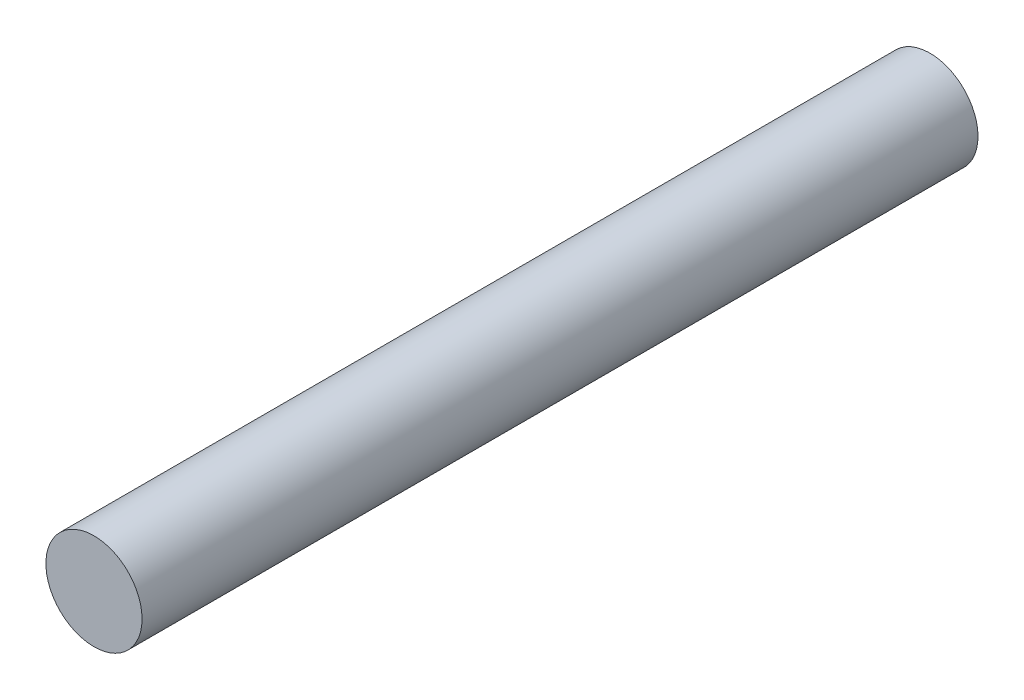
ISO-10303-21;
HEADER;
FILE_DESCRIPTION(('STEP AP214'),'2;1');
FILE_NAME('part.step','',(''),(''),'','','');
FILE_SCHEMA(('AUTOMOTIVE_DESIGN { 1 0 10303 214 1 1 1 1 }'));
ENDSEC;
DATA;
#1=APPLICATION_CONTEXT('core data for automotive mechanical design processes');
#2=APPLICATION_PROTOCOL_DEFINITION('international standard','automotive_design',2000,#1);
#3=PRODUCT_CONTEXT('',#1,'mechanical');
#4=PRODUCT('Part','Part','',(#3));
#5=PRODUCT_RELATED_PRODUCT_CATEGORY('part','',(#4));
#6=PRODUCT_DEFINITION_FORMATION('','',#4);
#7=PRODUCT_DEFINITION_CONTEXT('part definition',#1,'design');
#8=PRODUCT_DEFINITION('design','',#6,#7);
#9=PRODUCT_DEFINITION_SHAPE('','',#8);
#10=(LENGTH_UNIT() NAMED_UNIT(*) SI_UNIT(.MILLI.,.METRE.));
#11=(NAMED_UNIT(*) PLANE_ANGLE_UNIT() SI_UNIT($,.RADIAN.));
#12=(NAMED_UNIT(*) SI_UNIT($,.STERADIAN.) SOLID_ANGLE_UNIT());
#13=UNCERTAINTY_MEASURE_WITH_UNIT(LENGTH_MEASURE(1.E-05),#10,'distance_accuracy_value','');
#14=(GEOMETRIC_REPRESENTATION_CONTEXT(3) GLOBAL_UNCERTAINTY_ASSIGNED_CONTEXT((#13)) GLOBAL_UNIT_ASSIGNED_CONTEXT((#10,
#11,#12)) REPRESENTATION_CONTEXT('',''));
#15=CARTESIAN_POINT('',(0.,0.,0.));
#16=DIRECTION('',(0.,0.,1.));
#17=DIRECTION('',(1.,0.,0.));
#18=AXIS2_PLACEMENT_3D('',#15,#16,#17);
#19=CARTESIAN_POINT('',(0.,0.,101.6));
#20=DIRECTION('',(0.,0.,-1.));
#21=DIRECTION('',(-1.,0.,0.));
#22=AXIS2_PLACEMENT_3D('',#19,#20,#21);
#23=CYLINDRICAL_SURFACE('',#22,5.842);
#24=CARTESIAN_POINT('',(0.,0.,101.6));
#25=DIRECTION('',(0.,0.,1.));
#26=DIRECTION('',(1.,0.,0.));
#27=AXIS2_PLACEMENT_3D('',#24,#25,#26);
#28=CIRCLE('',#27,5.842);
#29=CARTESIAN_POINT('',(5.842,0.,101.6));
#30=VERTEX_POINT('',#29);
#31=EDGE_CURVE('E10',#30,#30,#28,.T.);
#32=ORIENTED_EDGE('',*,*,#31,.F.);
#33=EDGE_LOOP('',(#32));
#34=FACE_BOUND('',#33,.T.);
#35=CARTESIAN_POINT('',(0.,0.,0.));
#36=DIRECTION('',(0.,0.,1.));
#37=DIRECTION('',(1.,0.,0.));
#38=AXIS2_PLACEMENT_3D('',#35,#36,#37);
#39=CIRCLE('',#38,5.842);
#40=CARTESIAN_POINT('',(5.842,0.,0.));
#41=VERTEX_POINT('',#40);
#42=EDGE_CURVE('E40',#41,#41,#39,.T.);
#43=ORIENTED_EDGE('',*,*,#42,.T.);
#44=EDGE_LOOP('',(#43));
#45=FACE_BOUND('',#44,.T.);
#46=ADVANCED_FACE('F37',(#34,#45),#23,.T.);
#47=CARTESIAN_POINT('',(0.,0.,101.6));
#48=DIRECTION('',(0.,0.,1.));
#49=DIRECTION('',(1.,0.,0.));
#50=AXIS2_PLACEMENT_3D('',#47,#48,#49);
#51=PLANE('',#50);
#52=ORIENTED_EDGE('',*,*,#31,.T.);
#53=EDGE_LOOP('',(#52));
#54=FACE_BOUND('',#53,.T.);
#55=ADVANCED_FACE('F54',(#54),#51,.T.);
#56=CARTESIAN_POINT('',(0.,0.,0.));
#57=DIRECTION('',(0.,0.,1.));
#58=DIRECTION('',(1.,0.,0.));
#59=AXIS2_PLACEMENT_3D('',#56,#57,#58);
#60=PLANE('',#59);
#61=ORIENTED_EDGE('',*,*,#42,.F.);
#62=EDGE_LOOP('',(#61));
#63=FACE_BOUND('',#62,.T.);
#64=ADVANCED_FACE('F52',(#63),#60,.F.);
#65=CLOSED_SHELL('',(#46,#55,#64));
#66=MANIFOLD_SOLID_BREP('B2',#65);
#67=ADVANCED_BREP_SHAPE_REPRESENTATION('',(#18,#66),#14);
#68=SHAPE_DEFINITION_REPRESENTATION(#9,#67);
ENDSEC;
END-ISO-10303-21;
